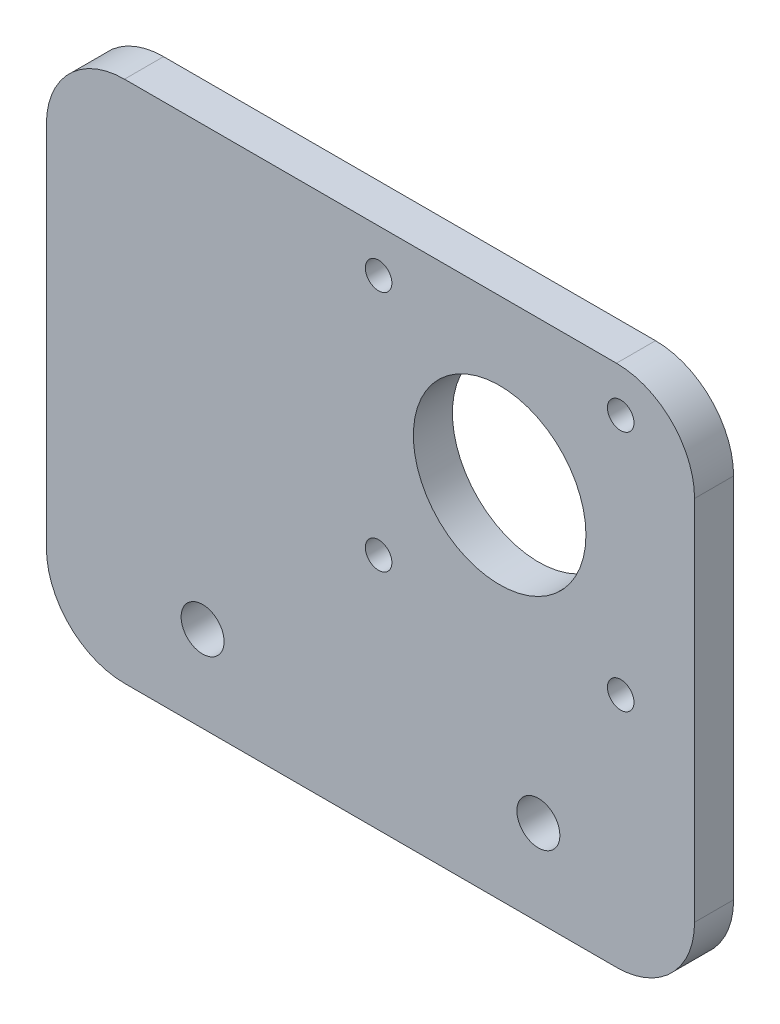
ISO-10303-21;
HEADER;
FILE_DESCRIPTION(('STEP AP214'),'2;1');
FILE_NAME('part.step','',(''),(''),'','','');
FILE_SCHEMA(('AUTOMOTIVE_DESIGN { 1 0 10303 214 1 1 1 1 }'));
ENDSEC;
DATA;
#1=APPLICATION_CONTEXT('core data for automotive mechanical design processes');
#2=APPLICATION_PROTOCOL_DEFINITION('international standard','automotive_design',2000,#1);
#3=PRODUCT_CONTEXT('',#1,'mechanical');
#4=PRODUCT('Part','Part','',(#3));
#5=PRODUCT_RELATED_PRODUCT_CATEGORY('part','',(#4));
#6=PRODUCT_DEFINITION_FORMATION('','',#4);
#7=PRODUCT_DEFINITION_CONTEXT('part definition',#1,'design');
#8=PRODUCT_DEFINITION('design','',#6,#7);
#9=PRODUCT_DEFINITION_SHAPE('','',#8);
#10=(LENGTH_UNIT() NAMED_UNIT(*) SI_UNIT(.MILLI.,.METRE.));
#11=(NAMED_UNIT(*) PLANE_ANGLE_UNIT() SI_UNIT($,.RADIAN.));
#12=(NAMED_UNIT(*) SI_UNIT($,.STERADIAN.) SOLID_ANGLE_UNIT());
#13=UNCERTAINTY_MEASURE_WITH_UNIT(LENGTH_MEASURE(1.E-05),#10,'distance_accuracy_value','');
#14=(GEOMETRIC_REPRESENTATION_CONTEXT(3) GLOBAL_UNCERTAINTY_ASSIGNED_CONTEXT((#13)) GLOBAL_UNIT_ASSIGNED_CONTEXT((#10,
#11,#12)) REPRESENTATION_CONTEXT('',''));
#15=CARTESIAN_POINT('',(0.,0.,0.));
#16=DIRECTION('',(0.,0.,1.));
#17=DIRECTION('',(1.,0.,0.));
#18=AXIS2_PLACEMENT_3D('',#15,#16,#17);
#19=CARTESIAN_POINT('',(41.5,-33.5,5.));
#20=DIRECTION('',(-1.,0.,0.));
#21=DIRECTION('',(0.,0.,1.));
#22=AXIS2_PLACEMENT_3D('',#19,#20,#21);
#23=PLANE('',#22);
#24=DIRECTION('',(0.,1.,0.));
#25=VECTOR('',#24,1.);
#26=CARTESIAN_POINT('',(41.5,-33.5,5.));
#27=LINE('',#26,#25);
#28=CARTESIAN_POINT('',(41.5,-23.5,5.));
#29=VERTEX_POINT('',#28);
#30=CARTESIAN_POINT('',(41.5,23.5,5.));
#31=VERTEX_POINT('',#30);
#32=EDGE_CURVE('E139',#29,#31,#27,.T.);
#33=ORIENTED_EDGE('',*,*,#32,.F.);
#34=DIRECTION('',(0.,0.,-1.));
#35=VECTOR('',#34,1.);
#36=CARTESIAN_POINT('',(41.5,-23.5,5.));
#37=LINE('',#36,#35);
#38=CARTESIAN_POINT('',(41.5,-23.5,0.));
#39=VERTEX_POINT('',#38);
#40=EDGE_CURVE('E123',#29,#39,#37,.T.);
#41=ORIENTED_EDGE('',*,*,#40,.T.);
#42=DIRECTION('',(0.,1.,0.));
#43=VECTOR('',#42,1.);
#44=CARTESIAN_POINT('',(41.5,-33.5,0.));
#45=LINE('',#44,#43);
#46=CARTESIAN_POINT('',(41.5,23.5,0.));
#47=VERTEX_POINT('',#46);
#48=EDGE_CURVE('E136',#39,#47,#45,.T.);
#49=ORIENTED_EDGE('',*,*,#48,.T.);
#50=DIRECTION('',(0.,0.,-1.));
#51=VECTOR('',#50,1.);
#52=CARTESIAN_POINT('',(41.5,23.5,5.));
#53=LINE('',#52,#51);
#54=EDGE_CURVE('E142',#47,#31,#53,.F.);
#55=ORIENTED_EDGE('',*,*,#54,.T.);
#56=EDGE_LOOP('',(#33,#41,#49,#55));
#57=FACE_BOUND('',#56,.T.);
#58=ADVANCED_FACE('F41',(#57),#23,.F.);
#59=CARTESIAN_POINT('',(-41.5,33.5,5.));
#60=DIRECTION('',(0.,-1.,0.));
#61=DIRECTION('',(0.,0.,-1.));
#62=AXIS2_PLACEMENT_3D('',#59,#60,#61);
#63=PLANE('',#62);
#64=DIRECTION('',(-1.,0.,0.));
#65=VECTOR('',#64,1.);
#66=CARTESIAN_POINT('',(-41.5,33.5,0.));
#67=LINE('',#66,#65);
#68=CARTESIAN_POINT('',(31.5,33.5,0.));
#69=VERTEX_POINT('',#68);
#70=CARTESIAN_POINT('',(-31.5,33.5,0.));
#71=VERTEX_POINT('',#70);
#72=EDGE_CURVE('E147',#69,#71,#67,.T.);
#73=ORIENTED_EDGE('',*,*,#72,.T.);
#74=DIRECTION('',(0.,0.,-1.));
#75=VECTOR('',#74,1.);
#76=CARTESIAN_POINT('',(-31.5,33.5,5.));
#77=LINE('',#76,#75);
#78=CARTESIAN_POINT('',(-31.5,33.5,5.));
#79=VERTEX_POINT('',#78);
#80=EDGE_CURVE('E11',#71,#79,#77,.F.);
#81=ORIENTED_EDGE('',*,*,#80,.T.);
#82=DIRECTION('',(-1.,0.,0.));
#83=VECTOR('',#82,1.);
#84=CARTESIAN_POINT('',(-41.5,33.5,5.));
#85=LINE('',#84,#83);
#86=CARTESIAN_POINT('',(31.5,33.5,5.));
#87=VERTEX_POINT('',#86);
#88=EDGE_CURVE('E204',#87,#79,#85,.T.);
#89=ORIENTED_EDGE('',*,*,#88,.F.);
#90=DIRECTION('',(0.,0.,-1.));
#91=VECTOR('',#90,1.);
#92=CARTESIAN_POINT('',(31.5,33.5,5.));
#93=LINE('',#92,#91);
#94=EDGE_CURVE('E49',#87,#69,#93,.T.);
#95=ORIENTED_EDGE('',*,*,#94,.T.);
#96=EDGE_LOOP('',(#73,#81,#89,#95));
#97=FACE_BOUND('',#96,.T.);
#98=ADVANCED_FACE('F202',(#97),#63,.F.);
#99=CARTESIAN_POINT('',(-41.5,-33.5,5.));
#100=DIRECTION('',(1.,0.,0.));
#101=DIRECTION('',(0.,0.,-1.));
#102=AXIS2_PLACEMENT_3D('',#99,#100,#101);
#103=PLANE('',#102);
#104=DIRECTION('',(0.,-1.,0.));
#105=VECTOR('',#104,1.);
#106=CARTESIAN_POINT('',(-41.5,-33.5,0.));
#107=LINE('',#106,#105);
#108=CARTESIAN_POINT('',(-41.5,23.5,0.));
#109=VERTEX_POINT('',#108);
#110=CARTESIAN_POINT('',(-41.5,-23.5,0.));
#111=VERTEX_POINT('',#110);
#112=EDGE_CURVE('E154',#109,#111,#107,.T.);
#113=ORIENTED_EDGE('',*,*,#112,.T.);
#114=DIRECTION('',(0.,0.,-1.));
#115=VECTOR('',#114,1.);
#116=CARTESIAN_POINT('',(-41.5,-23.5,5.));
#117=LINE('',#116,#115);
#118=CARTESIAN_POINT('',(-41.5,-23.5,5.));
#119=VERTEX_POINT('',#118);
#120=EDGE_CURVE('E59',#111,#119,#117,.F.);
#121=ORIENTED_EDGE('',*,*,#120,.T.);
#122=DIRECTION('',(0.,-1.,0.));
#123=VECTOR('',#122,1.);
#124=CARTESIAN_POINT('',(-41.5,-33.5,5.));
#125=LINE('',#124,#123);
#126=CARTESIAN_POINT('',(-41.5,23.5,5.));
#127=VERTEX_POINT('',#126);
#128=EDGE_CURVE('E212',#127,#119,#125,.T.);
#129=ORIENTED_EDGE('',*,*,#128,.F.);
#130=DIRECTION('',(0.,0.,-1.));
#131=VECTOR('',#130,1.);
#132=CARTESIAN_POINT('',(-41.5,23.5,5.));
#133=LINE('',#132,#131);
#134=EDGE_CURVE('E191',#127,#109,#133,.T.);
#135=ORIENTED_EDGE('',*,*,#134,.T.);
#136=EDGE_LOOP('',(#113,#121,#129,#135));
#137=FACE_BOUND('',#136,.T.);
#138=ADVANCED_FACE('F211',(#137),#103,.F.);
#139=CARTESIAN_POINT('',(-41.5,-33.5,5.));
#140=DIRECTION('',(0.,1.,0.));
#141=DIRECTION('',(0.,0.,1.));
#142=AXIS2_PLACEMENT_3D('',#139,#140,#141);
#143=PLANE('',#142);
#144=DIRECTION('',(1.,0.,0.));
#145=VECTOR('',#144,1.);
#146=CARTESIAN_POINT('',(-41.5,-33.5,0.));
#147=LINE('',#146,#145);
#148=CARTESIAN_POINT('',(-31.5,-33.5,0.));
#149=VERTEX_POINT('',#148);
#150=CARTESIAN_POINT('',(31.5,-33.5,0.));
#151=VERTEX_POINT('',#150);
#152=EDGE_CURVE('E166',#149,#151,#147,.T.);
#153=ORIENTED_EDGE('',*,*,#152,.T.);
#154=DIRECTION('',(0.,0.,-1.));
#155=VECTOR('',#154,1.);
#156=CARTESIAN_POINT('',(31.5,-33.5,5.));
#157=LINE('',#156,#155);
#158=CARTESIAN_POINT('',(31.5,-33.5,5.));
#159=VERTEX_POINT('',#158);
#160=EDGE_CURVE('E124',#151,#159,#157,.F.);
#161=ORIENTED_EDGE('',*,*,#160,.T.);
#162=DIRECTION('',(1.,0.,0.));
#163=VECTOR('',#162,1.);
#164=CARTESIAN_POINT('',(-41.5,-33.5,5.));
#165=LINE('',#164,#163);
#166=CARTESIAN_POINT('',(-31.5,-33.5,5.));
#167=VERTEX_POINT('',#166);
#168=EDGE_CURVE('E161',#167,#159,#165,.T.);
#169=ORIENTED_EDGE('',*,*,#168,.F.);
#170=DIRECTION('',(0.,0.,-1.));
#171=VECTOR('',#170,1.);
#172=CARTESIAN_POINT('',(-31.5,-33.5,5.));
#173=LINE('',#172,#171);
#174=EDGE_CURVE('E130',#167,#149,#173,.T.);
#175=ORIENTED_EDGE('',*,*,#174,.T.);
#176=EDGE_LOOP('',(#153,#161,#169,#175));
#177=FACE_BOUND('',#176,.T.);
#178=ADVANCED_FACE('F283',(#177),#143,.F.);
#179=CARTESIAN_POINT('',(0.,0.,5.));
#180=DIRECTION('',(0.,0.,-1.));
#181=DIRECTION('',(-1.,0.,0.));
#182=AXIS2_PLACEMENT_3D('',#179,#180,#181);
#183=PLANE('',#182);
#184=CARTESIAN_POINT('',(16.541076623741,12.500005008226,5.));
#185=DIRECTION('',(0.,0.,1.));
#186=DIRECTION('',(1.,0.,0.));
#187=AXIS2_PLACEMENT_3D('',#184,#185,#186);
#188=CIRCLE('',#187,11.05);
#189=CARTESIAN_POINT('',(27.591076623741,12.500005008226,5.));
#190=VERTEX_POINT('',#189);
#191=EDGE_CURVE('E263',#190,#190,#188,.T.);
#192=ORIENTED_EDGE('',*,*,#191,.F.);
#193=EDGE_LOOP('',(#192));
#194=FACE_BOUND('',#193,.T.);
#195=CARTESIAN_POINT('',(32.0410762527028,28.0000047799934,5.));
#196=DIRECTION('',(0.,0.,-1.));
#197=DIRECTION('',(-1.,0.,0.));
#198=AXIS2_PLACEMENT_3D('',#195,#196,#197);
#199=CIRCLE('',#198,1.7);
#200=CARTESIAN_POINT('',(30.3410762527028,28.0000047799934,5.));
#201=VERTEX_POINT('',#200);
#202=EDGE_CURVE('E255',#201,#201,#199,.T.);
#203=ORIENTED_EDGE('',*,*,#202,.T.);
#204=EDGE_LOOP('',(#203));
#205=FACE_BOUND('',#204,.T.);
#206=CARTESIAN_POINT('',(1.04107625270284,28.0000047799933,5.));
#207=DIRECTION('',(0.,0.,-1.));
#208=DIRECTION('',(-1.,0.,0.));
#209=AXIS2_PLACEMENT_3D('',#206,#207,#208);
#210=CIRCLE('',#209,1.7);
#211=CARTESIAN_POINT('',(-0.658923747297156,28.0000047799933,5.));
#212=VERTEX_POINT('',#211);
#213=EDGE_CURVE('E248',#212,#212,#210,.T.);
#214=ORIENTED_EDGE('',*,*,#213,.T.);
#215=EDGE_LOOP('',(#214));
#216=FACE_BOUND('',#215,.T.);
#217=CARTESIAN_POINT('',(1.04107625270296,-2.99999522000675,5.));
#218=DIRECTION('',(0.,0.,-1.));
#219=DIRECTION('',(-1.,0.,0.));
#220=AXIS2_PLACEMENT_3D('',#217,#218,#219);
#221=CIRCLE('',#220,1.7);
#222=CARTESIAN_POINT('',(-0.658923747297043,-2.99999522000675,5.));
#223=VERTEX_POINT('',#222);
#224=EDGE_CURVE('E240',#223,#223,#221,.T.);
#225=ORIENTED_EDGE('',*,*,#224,.T.);
#226=EDGE_LOOP('',(#225));
#227=FACE_BOUND('',#226,.T.);
#228=CARTESIAN_POINT('',(32.041076252703,-2.99999522000664,5.));
#229=DIRECTION('',(0.,0.,-1.));
#230=DIRECTION('',(-1.,0.,0.));
#231=AXIS2_PLACEMENT_3D('',#228,#229,#230);
#232=CIRCLE('',#231,1.7);
#233=CARTESIAN_POINT('',(30.341076252703,-2.99999522000664,5.));
#234=VERTEX_POINT('',#233);
#235=EDGE_CURVE('E232',#234,#234,#232,.T.);
#236=ORIENTED_EDGE('',*,*,#235,.T.);
#237=EDGE_LOOP('',(#236));
#238=FACE_BOUND('',#237,.T.);
#239=CARTESIAN_POINT('',(21.5,-22.5,5.));
#240=DIRECTION('',(0.,0.,1.));
#241=DIRECTION('',(1.,0.,0.));
#242=AXIS2_PLACEMENT_3D('',#239,#240,#241);
#243=CIRCLE('',#242,2.75);
#244=CARTESIAN_POINT('',(24.25,-22.5,5.));
#245=VERTEX_POINT('',#244);
#246=EDGE_CURVE('E228',#245,#245,#243,.T.);
#247=ORIENTED_EDGE('',*,*,#246,.F.);
#248=EDGE_LOOP('',(#247));
#249=FACE_BOUND('',#248,.T.);
#250=CARTESIAN_POINT('',(-21.5,-22.5,5.));
#251=DIRECTION('',(0.,0.,1.));
#252=DIRECTION('',(1.,0.,0.));
#253=AXIS2_PLACEMENT_3D('',#250,#251,#252);
#254=CIRCLE('',#253,2.75);
#255=CARTESIAN_POINT('',(-18.75,-22.5,5.));
#256=VERTEX_POINT('',#255);
#257=EDGE_CURVE('E158',#256,#256,#254,.T.);
#258=ORIENTED_EDGE('',*,*,#257,.F.);
#259=EDGE_LOOP('',(#258));
#260=FACE_BOUND('',#259,.T.);
#261=ORIENTED_EDGE('',*,*,#168,.T.);
#262=CARTESIAN_POINT('',(31.5,-23.5,5.));
#263=DIRECTION('',(0.,0.,-1.));
#264=DIRECTION('',(-1.,0.,0.));
#265=AXIS2_PLACEMENT_3D('',#262,#263,#264);
#266=CIRCLE('',#265,10.);
#267=EDGE_CURVE('E188',#159,#29,#266,.F.);
#268=ORIENTED_EDGE('',*,*,#267,.T.);
#269=ORIENTED_EDGE('',*,*,#32,.T.);
#270=CARTESIAN_POINT('',(31.5,23.5,5.));
#271=DIRECTION('',(0.,0.,-1.));
#272=DIRECTION('',(-1.,0.,0.));
#273=AXIS2_PLACEMENT_3D('',#270,#271,#272);
#274=CIRCLE('',#273,10.);
#275=EDGE_CURVE('E181',#31,#87,#274,.F.);
#276=ORIENTED_EDGE('',*,*,#275,.T.);
#277=ORIENTED_EDGE('',*,*,#88,.T.);
#278=CARTESIAN_POINT('',(-31.5,23.5,5.));
#279=DIRECTION('',(0.,0.,-1.));
#280=DIRECTION('',(-1.,0.,0.));
#281=AXIS2_PLACEMENT_3D('',#278,#279,#280);
#282=CIRCLE('',#281,10.);
#283=EDGE_CURVE('E66',#79,#127,#282,.F.);
#284=ORIENTED_EDGE('',*,*,#283,.T.);
#285=ORIENTED_EDGE('',*,*,#128,.T.);
#286=CARTESIAN_POINT('',(-31.5,-23.5,5.));
#287=DIRECTION('',(0.,0.,-1.));
#288=DIRECTION('',(-1.,0.,0.));
#289=AXIS2_PLACEMENT_3D('',#286,#287,#288);
#290=CIRCLE('',#289,10.);
#291=EDGE_CURVE('E185',#119,#167,#290,.F.);
#292=ORIENTED_EDGE('',*,*,#291,.T.);
#293=EDGE_LOOP('',(#261,#268,#269,#276,#277,#284,#285,#292));
#294=FACE_BOUND('',#293,.T.);
#295=ADVANCED_FACE('F280',(#194,#205,#216,#227,#238,#249,#260,#294),#183,.F.);
#296=CARTESIAN_POINT('',(0.,0.,0.));
#297=DIRECTION('',(0.,0.,-1.));
#298=DIRECTION('',(-1.,0.,0.));
#299=AXIS2_PLACEMENT_3D('',#296,#297,#298);
#300=PLANE('',#299);
#301=CARTESIAN_POINT('',(16.541076623741,12.500005008226,0.));
#302=DIRECTION('',(0.,0.,1.));
#303=DIRECTION('',(1.,0.,0.));
#304=AXIS2_PLACEMENT_3D('',#301,#302,#303);
#305=CIRCLE('',#304,11.05);
#306=CARTESIAN_POINT('',(27.591076623741,12.500005008226,0.));
#307=VERTEX_POINT('',#306);
#308=EDGE_CURVE('E262',#307,#307,#305,.T.);
#309=ORIENTED_EDGE('',*,*,#308,.T.);
#310=EDGE_LOOP('',(#309));
#311=FACE_BOUND('',#310,.T.);
#312=CARTESIAN_POINT('',(32.0410762527028,28.0000047799934,0.));
#313=DIRECTION('',(0.,0.,-1.));
#314=DIRECTION('',(-1.,0.,0.));
#315=AXIS2_PLACEMENT_3D('',#312,#313,#314);
#316=CIRCLE('',#315,1.7);
#317=CARTESIAN_POINT('',(30.3410762527028,28.0000047799934,0.));
#318=VERTEX_POINT('',#317);
#319=EDGE_CURVE('E259',#318,#318,#316,.T.);
#320=ORIENTED_EDGE('',*,*,#319,.F.);
#321=EDGE_LOOP('',(#320));
#322=FACE_BOUND('',#321,.T.);
#323=CARTESIAN_POINT('',(1.04107625270284,28.0000047799933,0.));
#324=DIRECTION('',(0.,0.,-1.));
#325=DIRECTION('',(-1.,0.,0.));
#326=AXIS2_PLACEMENT_3D('',#323,#324,#325);
#327=CIRCLE('',#326,1.7);
#328=CARTESIAN_POINT('',(-0.658923747297156,28.0000047799933,0.));
#329=VERTEX_POINT('',#328);
#330=EDGE_CURVE('E252',#329,#329,#327,.T.);
#331=ORIENTED_EDGE('',*,*,#330,.F.);
#332=EDGE_LOOP('',(#331));
#333=FACE_BOUND('',#332,.T.);
#334=CARTESIAN_POINT('',(1.04107625270296,-2.99999522000675,0.));
#335=DIRECTION('',(0.,0.,-1.));
#336=DIRECTION('',(-1.,0.,0.));
#337=AXIS2_PLACEMENT_3D('',#334,#335,#336);
#338=CIRCLE('',#337,1.7);
#339=CARTESIAN_POINT('',(-0.658923747297043,-2.99999522000675,0.));
#340=VERTEX_POINT('',#339);
#341=EDGE_CURVE('E244',#340,#340,#338,.T.);
#342=ORIENTED_EDGE('',*,*,#341,.F.);
#343=EDGE_LOOP('',(#342));
#344=FACE_BOUND('',#343,.T.);
#345=CARTESIAN_POINT('',(32.041076252703,-2.99999522000664,0.));
#346=DIRECTION('',(0.,0.,-1.));
#347=DIRECTION('',(-1.,0.,0.));
#348=AXIS2_PLACEMENT_3D('',#345,#346,#347);
#349=CIRCLE('',#348,1.7);
#350=CARTESIAN_POINT('',(30.341076252703,-2.99999522000664,0.));
#351=VERTEX_POINT('',#350);
#352=EDGE_CURVE('E236',#351,#351,#349,.T.);
#353=ORIENTED_EDGE('',*,*,#352,.F.);
#354=EDGE_LOOP('',(#353));
#355=FACE_BOUND('',#354,.T.);
#356=CARTESIAN_POINT('',(21.5,-22.5,0.));
#357=DIRECTION('',(0.,0.,1.));
#358=DIRECTION('',(1.,0.,0.));
#359=AXIS2_PLACEMENT_3D('',#356,#357,#358);
#360=CIRCLE('',#359,2.75);
#361=CARTESIAN_POINT('',(24.25,-22.5,0.));
#362=VERTEX_POINT('',#361);
#363=EDGE_CURVE('E224',#362,#362,#360,.T.);
#364=ORIENTED_EDGE('',*,*,#363,.T.);
#365=EDGE_LOOP('',(#364));
#366=FACE_BOUND('',#365,.T.);
#367=CARTESIAN_POINT('',(-21.5,-22.5,0.));
#368=DIRECTION('',(0.,0.,1.));
#369=DIRECTION('',(1.,0.,0.));
#370=AXIS2_PLACEMENT_3D('',#367,#368,#369);
#371=CIRCLE('',#370,2.75);
#372=CARTESIAN_POINT('',(-18.75,-22.5,0.));
#373=VERTEX_POINT('',#372);
#374=EDGE_CURVE('E148',#373,#373,#371,.T.);
#375=ORIENTED_EDGE('',*,*,#374,.T.);
#376=EDGE_LOOP('',(#375));
#377=FACE_BOUND('',#376,.T.);
#378=ORIENTED_EDGE('',*,*,#48,.F.);
#379=CARTESIAN_POINT('',(31.5,-23.5,0.));
#380=DIRECTION('',(0.,0.,-1.));
#381=DIRECTION('',(-1.,0.,0.));
#382=AXIS2_PLACEMENT_3D('',#379,#380,#381);
#383=CIRCLE('',#382,10.);
#384=EDGE_CURVE('E119',#39,#151,#383,.T.);
#385=ORIENTED_EDGE('',*,*,#384,.T.);
#386=ORIENTED_EDGE('',*,*,#152,.F.);
#387=CARTESIAN_POINT('',(-31.5,-23.5,0.));
#388=DIRECTION('',(0.,0.,-1.));
#389=DIRECTION('',(-1.,0.,0.));
#390=AXIS2_PLACEMENT_3D('',#387,#388,#389);
#391=CIRCLE('',#390,10.);
#392=EDGE_CURVE('E131',#149,#111,#391,.T.);
#393=ORIENTED_EDGE('',*,*,#392,.T.);
#394=ORIENTED_EDGE('',*,*,#112,.F.);
#395=CARTESIAN_POINT('',(-31.5,23.5,0.));
#396=DIRECTION('',(0.,0.,-1.));
#397=DIRECTION('',(-1.,0.,0.));
#398=AXIS2_PLACEMENT_3D('',#395,#396,#397);
#399=CIRCLE('',#398,10.);
#400=EDGE_CURVE('E172',#109,#71,#399,.T.);
#401=ORIENTED_EDGE('',*,*,#400,.T.);
#402=ORIENTED_EDGE('',*,*,#72,.F.);
#403=CARTESIAN_POINT('',(31.5,23.5,0.));
#404=DIRECTION('',(0.,0.,-1.));
#405=DIRECTION('',(-1.,0.,0.));
#406=AXIS2_PLACEMENT_3D('',#403,#404,#405);
#407=CIRCLE('',#406,10.);
#408=EDGE_CURVE('E141',#69,#47,#407,.T.);
#409=ORIENTED_EDGE('',*,*,#408,.T.);
#410=EDGE_LOOP('',(#378,#385,#386,#393,#394,#401,#402,#409));
#411=FACE_BOUND('',#410,.T.);
#412=ADVANCED_FACE('F144',(#311,#322,#333,#344,#355,#366,#377,#411),#300,.T.);
#413=CARTESIAN_POINT('',(-21.5,-22.5,5.));
#414=DIRECTION('',(0.,0.,1.));
#415=DIRECTION('',(1.,0.,0.));
#416=AXIS2_PLACEMENT_3D('',#413,#414,#415);
#417=CYLINDRICAL_SURFACE('',#416,2.75);
#418=ORIENTED_EDGE('',*,*,#374,.F.);
#419=EDGE_LOOP('',(#418));
#420=FACE_BOUND('',#419,.T.);
#421=ORIENTED_EDGE('',*,*,#257,.T.);
#422=EDGE_LOOP('',(#421));
#423=FACE_BOUND('',#422,.T.);
#424=ADVANCED_FACE('F320',(#420,#423),#417,.F.);
#425=CARTESIAN_POINT('',(21.5,-22.5,5.));
#426=DIRECTION('',(0.,0.,1.));
#427=DIRECTION('',(1.,0.,0.));
#428=AXIS2_PLACEMENT_3D('',#425,#426,#427);
#429=CYLINDRICAL_SURFACE('',#428,2.75);
#430=ORIENTED_EDGE('',*,*,#363,.F.);
#431=EDGE_LOOP('',(#430));
#432=FACE_BOUND('',#431,.T.);
#433=ORIENTED_EDGE('',*,*,#246,.T.);
#434=EDGE_LOOP('',(#433));
#435=FACE_BOUND('',#434,.T.);
#436=ADVANCED_FACE('F324',(#432,#435),#429,.F.);
#437=CARTESIAN_POINT('',(32.041076252703,-2.99999522000664,0.));
#438=DIRECTION('',(0.,0.,-1.));
#439=DIRECTION('',(-1.,0.,0.));
#440=AXIS2_PLACEMENT_3D('',#437,#438,#439);
#441=CYLINDRICAL_SURFACE('',#440,1.7);
#442=ORIENTED_EDGE('',*,*,#235,.F.);
#443=EDGE_LOOP('',(#442));
#444=FACE_BOUND('',#443,.T.);
#445=ORIENTED_EDGE('',*,*,#352,.T.);
#446=EDGE_LOOP('',(#445));
#447=FACE_BOUND('',#446,.T.);
#448=ADVANCED_FACE('F328',(#444,#447),#441,.F.);
#449=CARTESIAN_POINT('',(1.04107625270296,-2.99999522000675,0.));
#450=DIRECTION('',(0.,0.,-1.));
#451=DIRECTION('',(-1.,0.,0.));
#452=AXIS2_PLACEMENT_3D('',#449,#450,#451);
#453=CYLINDRICAL_SURFACE('',#452,1.7);
#454=ORIENTED_EDGE('',*,*,#224,.F.);
#455=EDGE_LOOP('',(#454));
#456=FACE_BOUND('',#455,.T.);
#457=ORIENTED_EDGE('',*,*,#341,.T.);
#458=EDGE_LOOP('',(#457));
#459=FACE_BOUND('',#458,.T.);
#460=ADVANCED_FACE('F332',(#456,#459),#453,.F.);
#461=CARTESIAN_POINT('',(1.04107625270284,28.0000047799933,0.));
#462=DIRECTION('',(0.,0.,-1.));
#463=DIRECTION('',(-1.,0.,0.));
#464=AXIS2_PLACEMENT_3D('',#461,#462,#463);
#465=CYLINDRICAL_SURFACE('',#464,1.7);
#466=ORIENTED_EDGE('',*,*,#213,.F.);
#467=EDGE_LOOP('',(#466));
#468=FACE_BOUND('',#467,.T.);
#469=ORIENTED_EDGE('',*,*,#330,.T.);
#470=EDGE_LOOP('',(#469));
#471=FACE_BOUND('',#470,.T.);
#472=ADVANCED_FACE('F336',(#468,#471),#465,.F.);
#473=CARTESIAN_POINT('',(32.0410762527028,28.0000047799934,0.));
#474=DIRECTION('',(0.,0.,-1.));
#475=DIRECTION('',(-1.,0.,0.));
#476=AXIS2_PLACEMENT_3D('',#473,#474,#475);
#477=CYLINDRICAL_SURFACE('',#476,1.7);
#478=ORIENTED_EDGE('',*,*,#202,.F.);
#479=EDGE_LOOP('',(#478));
#480=FACE_BOUND('',#479,.T.);
#481=ORIENTED_EDGE('',*,*,#319,.T.);
#482=EDGE_LOOP('',(#481));
#483=FACE_BOUND('',#482,.T.);
#484=ADVANCED_FACE('F276',(#480,#483),#477,.F.);
#485=CARTESIAN_POINT('',(16.541076623741,12.500005008226,0.));
#486=DIRECTION('',(0.,0.,1.));
#487=DIRECTION('',(1.,0.,0.));
#488=AXIS2_PLACEMENT_3D('',#485,#486,#487);
#489=CYLINDRICAL_SURFACE('',#488,11.05);
#490=ORIENTED_EDGE('',*,*,#308,.F.);
#491=EDGE_LOOP('',(#490));
#492=FACE_BOUND('',#491,.T.);
#493=ORIENTED_EDGE('',*,*,#191,.T.);
#494=EDGE_LOOP('',(#493));
#495=FACE_BOUND('',#494,.T.);
#496=ADVANCED_FACE('F273',(#492,#495),#489,.F.);
#497=CARTESIAN_POINT('',(31.5,-23.5,5.));
#498=DIRECTION('',(0.,0.,-1.));
#499=DIRECTION('',(-1.,0.,0.));
#500=AXIS2_PLACEMENT_3D('',#497,#498,#499);
#501=CYLINDRICAL_SURFACE('',#500,10.);
#502=ORIENTED_EDGE('',*,*,#267,.F.);
#503=ORIENTED_EDGE('',*,*,#160,.F.);
#504=ORIENTED_EDGE('',*,*,#384,.F.);
#505=ORIENTED_EDGE('',*,*,#40,.F.);
#506=EDGE_LOOP('',(#502,#503,#504,#505));
#507=FACE_BOUND('',#506,.T.);
#508=ADVANCED_FACE('F122',(#507),#501,.T.);
#509=CARTESIAN_POINT('',(-31.5,-23.5,5.));
#510=DIRECTION('',(0.,0.,-1.));
#511=DIRECTION('',(-1.,0.,0.));
#512=AXIS2_PLACEMENT_3D('',#509,#510,#511);
#513=CYLINDRICAL_SURFACE('',#512,10.);
#514=ORIENTED_EDGE('',*,*,#291,.F.);
#515=ORIENTED_EDGE('',*,*,#120,.F.);
#516=ORIENTED_EDGE('',*,*,#392,.F.);
#517=ORIENTED_EDGE('',*,*,#174,.F.);
#518=EDGE_LOOP('',(#514,#515,#516,#517));
#519=FACE_BOUND('',#518,.T.);
#520=ADVANCED_FACE('F300',(#519),#513,.T.);
#521=CARTESIAN_POINT('',(-31.5,23.5,5.));
#522=DIRECTION('',(0.,0.,-1.));
#523=DIRECTION('',(-1.,0.,0.));
#524=AXIS2_PLACEMENT_3D('',#521,#522,#523);
#525=CYLINDRICAL_SURFACE('',#524,10.);
#526=ORIENTED_EDGE('',*,*,#283,.F.);
#527=ORIENTED_EDGE('',*,*,#80,.F.);
#528=ORIENTED_EDGE('',*,*,#400,.F.);
#529=ORIENTED_EDGE('',*,*,#134,.F.);
#530=EDGE_LOOP('',(#526,#527,#528,#529));
#531=FACE_BOUND('',#530,.T.);
#532=ADVANCED_FACE('F210',(#531),#525,.T.);
#533=CARTESIAN_POINT('',(31.5,23.5,5.));
#534=DIRECTION('',(0.,0.,-1.));
#535=DIRECTION('',(-1.,0.,0.));
#536=AXIS2_PLACEMENT_3D('',#533,#534,#535);
#537=CYLINDRICAL_SURFACE('',#536,10.);
#538=ORIENTED_EDGE('',*,*,#275,.F.);
#539=ORIENTED_EDGE('',*,*,#54,.F.);
#540=ORIENTED_EDGE('',*,*,#408,.F.);
#541=ORIENTED_EDGE('',*,*,#94,.F.);
#542=EDGE_LOOP('',(#538,#539,#540,#541));
#543=FACE_BOUND('',#542,.T.);
#544=ADVANCED_FACE('F43',(#543),#537,.T.);
#545=CLOSED_SHELL('',(#58,#98,#138,#178,#295,#412,#424,#436,#448,#460,#472,#484,#496,#508,#520,
#532,#544));
#546=MANIFOLD_SOLID_BREP('B2',#545);
#547=ADVANCED_BREP_SHAPE_REPRESENTATION('',(#18,#546),#14);
#548=SHAPE_DEFINITION_REPRESENTATION(#9,#547);
ENDSEC;
END-ISO-10303-21;
